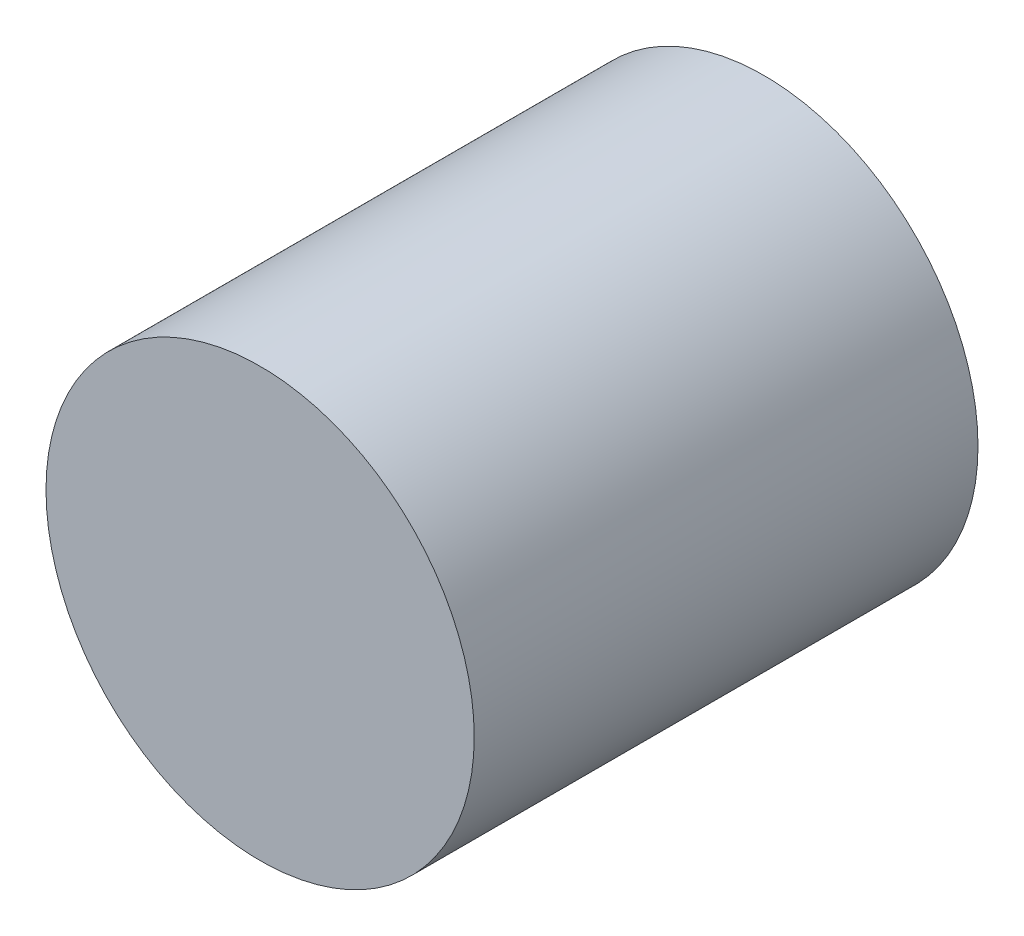
ISO-10303-21;
HEADER;
FILE_DESCRIPTION(('STEP AP214'),'2;1');
FILE_NAME('part.step','',(''),(''),'','','');
FILE_SCHEMA(('AUTOMOTIVE_DESIGN { 1 0 10303 214 1 1 1 1 }'));
ENDSEC;
DATA;
#1=APPLICATION_CONTEXT('core data for automotive mechanical design processes');
#2=APPLICATION_PROTOCOL_DEFINITION('international standard','automotive_design',2000,#1);
#3=PRODUCT_CONTEXT('',#1,'mechanical');
#4=PRODUCT('Part','Part','',(#3));
#5=PRODUCT_RELATED_PRODUCT_CATEGORY('part','',(#4));
#6=PRODUCT_DEFINITION_FORMATION('','',#4);
#7=PRODUCT_DEFINITION_CONTEXT('part definition',#1,'design');
#8=PRODUCT_DEFINITION('design','',#6,#7);
#9=PRODUCT_DEFINITION_SHAPE('','',#8);
#10=(LENGTH_UNIT() NAMED_UNIT(*) SI_UNIT(.MILLI.,.METRE.));
#11=(NAMED_UNIT(*) PLANE_ANGLE_UNIT() SI_UNIT($,.RADIAN.));
#12=(NAMED_UNIT(*) SI_UNIT($,.STERADIAN.) SOLID_ANGLE_UNIT());
#13=UNCERTAINTY_MEASURE_WITH_UNIT(LENGTH_MEASURE(1.E-05),#10,'distance_accuracy_value','');
#14=(GEOMETRIC_REPRESENTATION_CONTEXT(3) GLOBAL_UNCERTAINTY_ASSIGNED_CONTEXT((#13)) GLOBAL_UNIT_ASSIGNED_CONTEXT((#10,
#11,#12)) REPRESENTATION_CONTEXT('',''));
#15=CARTESIAN_POINT('',(0.,0.,0.));
#16=DIRECTION('',(0.,0.,1.));
#17=DIRECTION('',(1.,0.,0.));
#18=AXIS2_PLACEMENT_3D('',#15,#16,#17);
#19=CARTESIAN_POINT('',(0.,0.,20.));
#20=DIRECTION('',(0.,0.,-1.));
#21=DIRECTION('',(-1.,0.,0.));
#22=AXIS2_PLACEMENT_3D('',#19,#20,#21);
#23=CYLINDRICAL_SURFACE('',#22,8.5);
#24=CARTESIAN_POINT('',(0.,0.,20.));
#25=DIRECTION('',(0.,0.,1.));
#26=DIRECTION('',(1.,0.,0.));
#27=AXIS2_PLACEMENT_3D('',#24,#25,#26);
#28=CIRCLE('',#27,8.5);
#29=CARTESIAN_POINT('',(8.5,0.,20.));
#30=VERTEX_POINT('',#29);
#31=EDGE_CURVE('E10',#30,#30,#28,.T.);
#32=ORIENTED_EDGE('',*,*,#31,.F.);
#33=EDGE_LOOP('',(#32));
#34=FACE_BOUND('',#33,.T.);
#35=CARTESIAN_POINT('',(0.,0.,0.));
#36=DIRECTION('',(0.,0.,1.));
#37=DIRECTION('',(1.,0.,0.));
#38=AXIS2_PLACEMENT_3D('',#35,#36,#37);
#39=CIRCLE('',#38,8.5);
#40=CARTESIAN_POINT('',(8.5,0.,0.));
#41=VERTEX_POINT('',#40);
#42=EDGE_CURVE('E35',#41,#41,#39,.T.);
#43=ORIENTED_EDGE('',*,*,#42,.T.);
#44=EDGE_LOOP('',(#43));
#45=FACE_BOUND('',#44,.T.);
#46=ADVANCED_FACE('F32',(#34,#45),#23,.T.);
#47=CARTESIAN_POINT('',(0.,0.,20.));
#48=DIRECTION('',(0.,0.,1.));
#49=DIRECTION('',(1.,0.,0.));
#50=AXIS2_PLACEMENT_3D('',#47,#48,#49);
#51=PLANE('',#50);
#52=ORIENTED_EDGE('',*,*,#31,.T.);
#53=EDGE_LOOP('',(#52));
#54=FACE_BOUND('',#53,.T.);
#55=ADVANCED_FACE('F47',(#54),#51,.T.);
#56=CARTESIAN_POINT('',(0.,0.,0.));
#57=DIRECTION('',(0.,0.,1.));
#58=DIRECTION('',(1.,0.,0.));
#59=AXIS2_PLACEMENT_3D('',#56,#57,#58);
#60=PLANE('',#59);
#61=ORIENTED_EDGE('',*,*,#42,.F.);
#62=EDGE_LOOP('',(#61));
#63=FACE_BOUND('',#62,.T.);
#64=ADVANCED_FACE('F45',(#63),#60,.F.);
#65=CLOSED_SHELL('',(#46,#55,#64));
#66=MANIFOLD_SOLID_BREP('B2',#65);
#67=ADVANCED_BREP_SHAPE_REPRESENTATION('',(#18,#66),#14);
#68=SHAPE_DEFINITION_REPRESENTATION(#9,#67);
ENDSEC;
END-ISO-10303-21;
